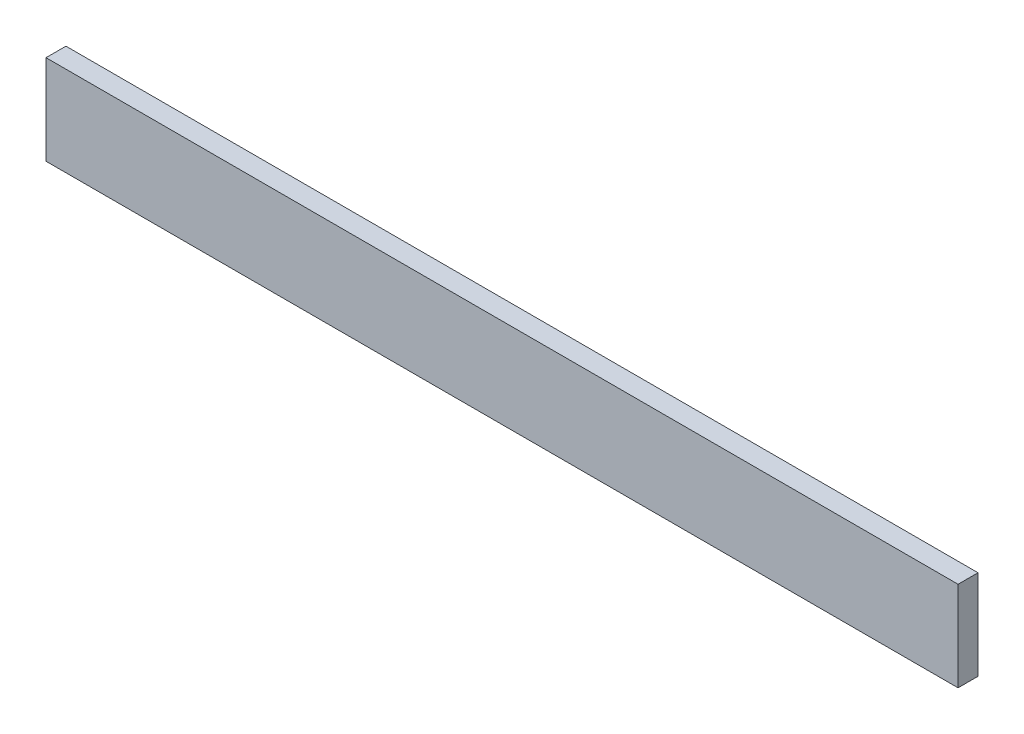
ISO-10303-21;
HEADER;
FILE_DESCRIPTION(('STEP AP214'),'2;1');
FILE_NAME('part.step','',(''),(''),'','','');
FILE_SCHEMA(('AUTOMOTIVE_DESIGN { 1 0 10303 214 1 1 1 1 }'));
ENDSEC;
DATA;
#1=APPLICATION_CONTEXT('core data for automotive mechanical design processes');
#2=APPLICATION_PROTOCOL_DEFINITION('international standard','automotive_design',2000,#1);
#3=PRODUCT_CONTEXT('',#1,'mechanical');
#4=PRODUCT('Part','Part','',(#3));
#5=PRODUCT_RELATED_PRODUCT_CATEGORY('part','',(#4));
#6=PRODUCT_DEFINITION_FORMATION('','',#4);
#7=PRODUCT_DEFINITION_CONTEXT('part definition',#1,'design');
#8=PRODUCT_DEFINITION('design','',#6,#7);
#9=PRODUCT_DEFINITION_SHAPE('','',#8);
#10=(LENGTH_UNIT() NAMED_UNIT(*) SI_UNIT(.MILLI.,.METRE.));
#11=(NAMED_UNIT(*) PLANE_ANGLE_UNIT() SI_UNIT($,.RADIAN.));
#12=(NAMED_UNIT(*) SI_UNIT($,.STERADIAN.) SOLID_ANGLE_UNIT());
#13=UNCERTAINTY_MEASURE_WITH_UNIT(LENGTH_MEASURE(1.E-05),#10,'distance_accuracy_value','');
#14=(GEOMETRIC_REPRESENTATION_CONTEXT(3) GLOBAL_UNCERTAINTY_ASSIGNED_CONTEXT((#13)) GLOBAL_UNIT_ASSIGNED_CONTEXT((#10,
#11,#12)) REPRESENTATION_CONTEXT('',''));
#15=CARTESIAN_POINT('',(0.,0.,0.));
#16=DIRECTION('',(0.,0.,1.));
#17=DIRECTION('',(1.,0.,0.));
#18=AXIS2_PLACEMENT_3D('',#15,#16,#17);
#19=CARTESIAN_POINT('',(0.,0.,-12.7));
#20=DIRECTION('',(0.,0.,-1.));
#21=DIRECTION('',(-1.,0.,0.));
#22=AXIS2_PLACEMENT_3D('',#19,#20,#21);
#23=PLANE('',#22);
#24=DIRECTION('',(1.,0.,0.));
#25=VECTOR('',#24,1.);
#26=CARTESIAN_POINT('',(0.,0.,-12.7));
#27=LINE('',#26,#25);
#28=CARTESIAN_POINT('',(0.,0.,-12.7));
#29=VERTEX_POINT('',#28);
#30=CARTESIAN_POINT('',(581.025,0.,-12.7));
#31=VERTEX_POINT('',#30);
#32=EDGE_CURVE('E20',#29,#31,#27,.T.);
#33=ORIENTED_EDGE('',*,*,#32,.F.);
#34=DIRECTION('',(0.,1.,0.));
#35=VECTOR('',#34,1.);
#36=CARTESIAN_POINT('',(0.,0.,-12.7));
#37=LINE('',#36,#35);
#38=CARTESIAN_POINT('',(0.,57.15,-12.7));
#39=VERTEX_POINT('',#38);
#40=EDGE_CURVE('E80',#29,#39,#37,.T.);
#41=ORIENTED_EDGE('',*,*,#40,.T.);
#42=DIRECTION('',(1.,0.,0.));
#43=VECTOR('',#42,1.);
#44=CARTESIAN_POINT('',(0.,57.15,-12.7));
#45=LINE('',#44,#43);
#46=CARTESIAN_POINT('',(581.025,57.15,-12.7));
#47=VERTEX_POINT('',#46);
#48=EDGE_CURVE('E61',#47,#39,#45,.F.);
#49=ORIENTED_EDGE('',*,*,#48,.F.);
#50=DIRECTION('',(0.,1.,0.));
#51=VECTOR('',#50,1.);
#52=CARTESIAN_POINT('',(581.025,0.,-12.7));
#53=LINE('',#52,#51);
#54=EDGE_CURVE('E56',#31,#47,#53,.T.);
#55=ORIENTED_EDGE('',*,*,#54,.F.);
#56=EDGE_LOOP('',(#33,#41,#49,#55));
#57=FACE_BOUND('',#56,.T.);
#58=ADVANCED_FACE('F17',(#57),#23,.T.);
#59=CARTESIAN_POINT('',(0.,0.,0.));
#60=DIRECTION('',(0.,-1.,0.));
#61=DIRECTION('',(0.,0.,-1.));
#62=AXIS2_PLACEMENT_3D('',#59,#60,#61);
#63=PLANE('',#62);
#64=DIRECTION('',(1.,0.,0.));
#65=VECTOR('',#64,1.);
#66=CARTESIAN_POINT('',(0.,0.,0.));
#67=LINE('',#66,#65);
#68=CARTESIAN_POINT('',(0.,0.,0.));
#69=VERTEX_POINT('',#68);
#70=CARTESIAN_POINT('',(581.025,0.,0.));
#71=VERTEX_POINT('',#70);
#72=EDGE_CURVE('E83',#69,#71,#67,.T.);
#73=ORIENTED_EDGE('',*,*,#72,.F.);
#74=DIRECTION('',(0.,0.,-1.));
#75=VECTOR('',#74,1.);
#76=CARTESIAN_POINT('',(0.,0.,0.));
#77=LINE('',#76,#75);
#78=EDGE_CURVE('E68',#69,#29,#77,.T.);
#79=ORIENTED_EDGE('',*,*,#78,.T.);
#80=ORIENTED_EDGE('',*,*,#32,.T.);
#81=DIRECTION('',(0.,0.,-1.));
#82=VECTOR('',#81,1.);
#83=CARTESIAN_POINT('',(581.025,0.,0.));
#84=LINE('',#83,#82);
#85=EDGE_CURVE('E63',#71,#31,#84,.T.);
#86=ORIENTED_EDGE('',*,*,#85,.F.);
#87=EDGE_LOOP('',(#73,#79,#80,#86));
#88=FACE_BOUND('',#87,.T.);
#89=ADVANCED_FACE('F65',(#88),#63,.T.);
#90=CARTESIAN_POINT('',(581.025,0.,0.));
#91=DIRECTION('',(1.,0.,0.));
#92=DIRECTION('',(0.,0.,-1.));
#93=AXIS2_PLACEMENT_3D('',#90,#91,#92);
#94=PLANE('',#93);
#95=DIRECTION('',(0.,1.,0.));
#96=VECTOR('',#95,1.);
#97=CARTESIAN_POINT('',(581.025,57.15,0.));
#98=LINE('',#97,#96);
#99=CARTESIAN_POINT('',(581.025,57.15,0.));
#100=VERTEX_POINT('',#99);
#101=EDGE_CURVE('E72',#71,#100,#98,.T.);
#102=ORIENTED_EDGE('',*,*,#101,.F.);
#103=ORIENTED_EDGE('',*,*,#85,.T.);
#104=ORIENTED_EDGE('',*,*,#54,.T.);
#105=DIRECTION('',(0.,0.,1.));
#106=VECTOR('',#105,1.);
#107=CARTESIAN_POINT('',(581.025,57.15,-12.7));
#108=LINE('',#107,#106);
#109=EDGE_CURVE('E74',#100,#47,#108,.F.);
#110=ORIENTED_EDGE('',*,*,#109,.F.);
#111=EDGE_LOOP('',(#102,#103,#104,#110));
#112=FACE_BOUND('',#111,.T.);
#113=ADVANCED_FACE('F70',(#112),#94,.T.);
#114=CARTESIAN_POINT('',(0.,57.15,-12.7));
#115=DIRECTION('',(0.,1.,0.));
#116=DIRECTION('',(0.,0.,1.));
#117=AXIS2_PLACEMENT_3D('',#114,#115,#116);
#118=PLANE('',#117);
#119=ORIENTED_EDGE('',*,*,#48,.T.);
#120=DIRECTION('',(0.,0.,-1.));
#121=VECTOR('',#120,1.);
#122=CARTESIAN_POINT('',(0.,57.15,0.));
#123=LINE('',#122,#121);
#124=CARTESIAN_POINT('',(0.,57.15,0.));
#125=VERTEX_POINT('',#124);
#126=EDGE_CURVE('E35',#39,#125,#123,.F.);
#127=ORIENTED_EDGE('',*,*,#126,.T.);
#128=DIRECTION('',(1.,0.,0.));
#129=VECTOR('',#128,1.);
#130=CARTESIAN_POINT('',(0.,57.15,0.));
#131=LINE('',#130,#129);
#132=EDGE_CURVE('E26',#100,#125,#131,.F.);
#133=ORIENTED_EDGE('',*,*,#132,.F.);
#134=ORIENTED_EDGE('',*,*,#109,.T.);
#135=EDGE_LOOP('',(#119,#127,#133,#134));
#136=FACE_BOUND('',#135,.T.);
#137=ADVANCED_FACE('F89',(#136),#118,.T.);
#138=CARTESIAN_POINT('',(0.,0.,0.));
#139=DIRECTION('',(1.,0.,0.));
#140=DIRECTION('',(0.,0.,-1.));
#141=AXIS2_PLACEMENT_3D('',#138,#139,#140);
#142=PLANE('',#141);
#143=ORIENTED_EDGE('',*,*,#126,.F.);
#144=ORIENTED_EDGE('',*,*,#40,.F.);
#145=ORIENTED_EDGE('',*,*,#78,.F.);
#146=DIRECTION('',(0.,1.,0.));
#147=VECTOR('',#146,1.);
#148=CARTESIAN_POINT('',(0.,57.15,0.));
#149=LINE('',#148,#147);
#150=EDGE_CURVE('E11',#125,#69,#149,.F.);
#151=ORIENTED_EDGE('',*,*,#150,.F.);
#152=EDGE_LOOP('',(#143,#144,#145,#151));
#153=FACE_BOUND('',#152,.T.);
#154=ADVANCED_FACE('F91',(#153),#142,.F.);
#155=CARTESIAN_POINT('',(0.,57.15,0.));
#156=DIRECTION('',(0.,0.,1.));
#157=DIRECTION('',(1.,0.,0.));
#158=AXIS2_PLACEMENT_3D('',#155,#156,#157);
#159=PLANE('',#158);
#160=ORIENTED_EDGE('',*,*,#132,.T.);
#161=ORIENTED_EDGE('',*,*,#150,.T.);
#162=ORIENTED_EDGE('',*,*,#72,.T.);
#163=ORIENTED_EDGE('',*,*,#101,.T.);
#164=EDGE_LOOP('',(#160,#161,#162,#163));
#165=FACE_BOUND('',#164,.T.);
#166=ADVANCED_FACE('F88',(#165),#159,.T.);
#167=CLOSED_SHELL('',(#58,#89,#113,#137,#154,#166));
#168=MANIFOLD_SOLID_BREP('B1',#167);
#169=ADVANCED_BREP_SHAPE_REPRESENTATION('',(#18,#168),#14);
#170=SHAPE_DEFINITION_REPRESENTATION(#9,#169);
ENDSEC;
END-ISO-10303-21;
